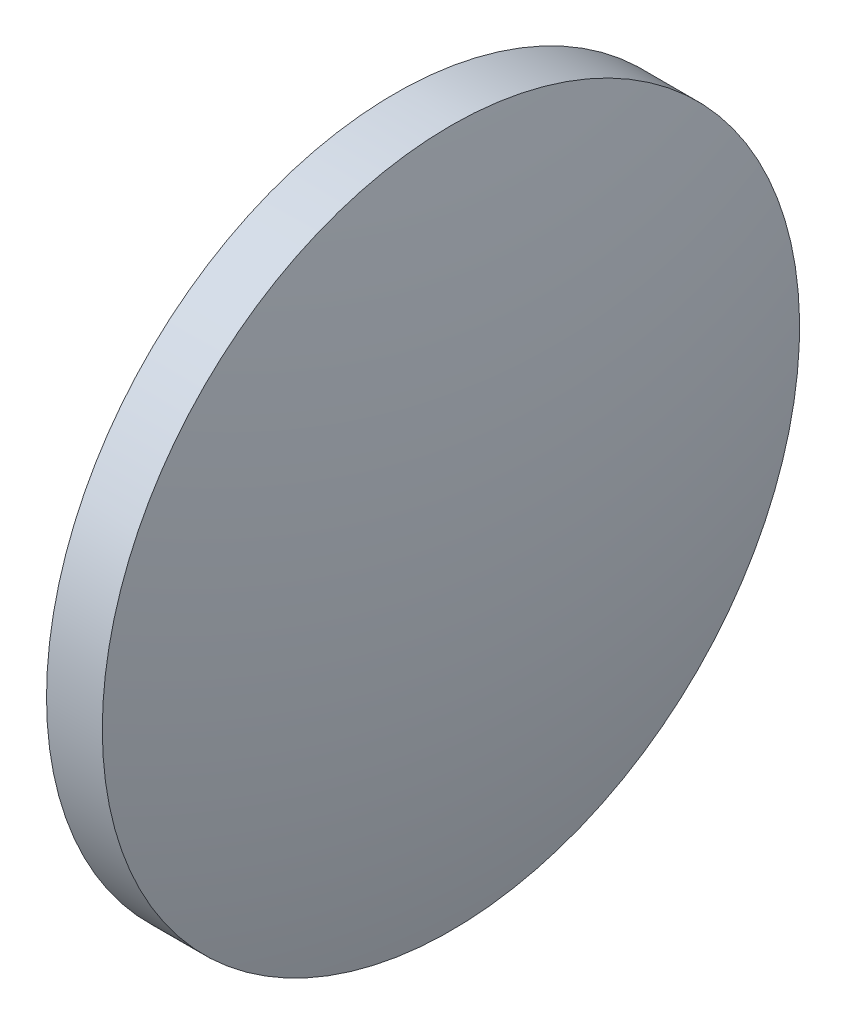
ISO-10303-21;
HEADER;
FILE_DESCRIPTION(('STEP AP214'),'2;1');
FILE_NAME('part.step','',(''),(''),'','','');
FILE_SCHEMA(('AUTOMOTIVE_DESIGN { 1 0 10303 214 1 1 1 1 }'));
ENDSEC;
DATA;
#1=APPLICATION_CONTEXT('core data for automotive mechanical design processes');
#2=APPLICATION_PROTOCOL_DEFINITION('international standard','automotive_design',2000,#1);
#3=PRODUCT_CONTEXT('',#1,'mechanical');
#4=PRODUCT('Part','Part','',(#3));
#5=PRODUCT_RELATED_PRODUCT_CATEGORY('part','',(#4));
#6=PRODUCT_DEFINITION_FORMATION('','',#4);
#7=PRODUCT_DEFINITION_CONTEXT('part definition',#1,'design');
#8=PRODUCT_DEFINITION('design','',#6,#7);
#9=PRODUCT_DEFINITION_SHAPE('','',#8);
#10=(LENGTH_UNIT() NAMED_UNIT(*) SI_UNIT(.MILLI.,.METRE.));
#11=(NAMED_UNIT(*) PLANE_ANGLE_UNIT() SI_UNIT($,.RADIAN.));
#12=(NAMED_UNIT(*) SI_UNIT($,.STERADIAN.) SOLID_ANGLE_UNIT());
#13=UNCERTAINTY_MEASURE_WITH_UNIT(LENGTH_MEASURE(1.E-05),#10,'distance_accuracy_value','');
#14=(GEOMETRIC_REPRESENTATION_CONTEXT(3) GLOBAL_UNCERTAINTY_ASSIGNED_CONTEXT((#13)) GLOBAL_UNIT_ASSIGNED_CONTEXT((#10,
#11,#12)) REPRESENTATION_CONTEXT('',''));
#15=CARTESIAN_POINT('',(0.,0.,0.));
#16=DIRECTION('',(0.,0.,1.));
#17=DIRECTION('',(1.,0.,0.));
#18=AXIS2_PLACEMENT_3D('',#15,#16,#17);
#19=CARTESIAN_POINT('',(8.73788358746325,32.5104726899811,0.));
#20=DIRECTION('',(-1.,0.,0.));
#21=DIRECTION('',(0.,1.,0.));
#22=AXIS2_PLACEMENT_3D('',#19,#20,#21);
#23=SPHERICAL_SURFACE('',#22,51.5005194805195);
#24=CARTESIAN_POINT('',(58.6984030679828,32.5104726899811,0.));
#25=DIRECTION('',(-1.,0.,0.));
#26=DIRECTION('',(0.,0.,1.));
#27=AXIS2_PLACEMENT_3D('',#24,#25,#26);
#28=CIRCLE('',#27,12.5);
#29=CARTESIAN_POINT('',(58.6984030679828,32.5104726899811,12.5));
#30=VERTEX_POINT('',#29);
#31=EDGE_CURVE('E10',#30,#30,#28,.T.);
#32=ORIENTED_EDGE('',*,*,#31,.F.);
#33=EDGE_LOOP('',(#32));
#34=FACE_BOUND('',#33,.T.);
#35=ADVANCED_FACE('F35',(#34),#23,.T.);
#36=CARTESIAN_POINT('',(54.3327871652218,32.5104726899811,0.));
#37=DIRECTION('',(-1.,0.,0.));
#38=DIRECTION('',(0.,0.,1.));
#39=AXIS2_PLACEMENT_3D('',#36,#37,#38);
#40=CYLINDRICAL_SURFACE('',#39,12.5);
#41=CARTESIAN_POINT('',(56.6984030679828,32.5104726899811,0.));
#42=DIRECTION('',(-1.,0.,0.));
#43=DIRECTION('',(0.,0.,1.));
#44=AXIS2_PLACEMENT_3D('',#41,#42,#43);
#45=CIRCLE('',#44,12.5);
#46=CARTESIAN_POINT('',(56.6984030679828,32.5104726899811,12.5));
#47=VERTEX_POINT('',#46);
#48=EDGE_CURVE('E41',#47,#47,#45,.T.);
#49=ORIENTED_EDGE('',*,*,#48,.F.);
#50=EDGE_LOOP('',(#49));
#51=FACE_BOUND('',#50,.T.);
#52=ORIENTED_EDGE('',*,*,#31,.T.);
#53=EDGE_LOOP('',(#52));
#54=FACE_BOUND('',#53,.T.);
#55=ADVANCED_FACE('F49',(#51,#54),#40,.T.);
#56=CARTESIAN_POINT('',(56.6984030679828,32.5104726899811,0.));
#57=DIRECTION('',(1.,0.,0.));
#58=DIRECTION('',(0.,0.,-1.));
#59=AXIS2_PLACEMENT_3D('',#56,#57,#58);
#60=PLANE('',#59);
#61=ORIENTED_EDGE('',*,*,#48,.T.);
#62=EDGE_LOOP('',(#61));
#63=FACE_BOUND('',#62,.T.);
#64=ADVANCED_FACE('F47',(#63),#60,.F.);
#65=CLOSED_SHELL('',(#35,#55,#64));
#66=MANIFOLD_SOLID_BREP('B2',#65);
#67=ADVANCED_BREP_SHAPE_REPRESENTATION('',(#18,#66),#14);
#68=SHAPE_DEFINITION_REPRESENTATION(#9,#67);
ENDSEC;
END-ISO-10303-21;
